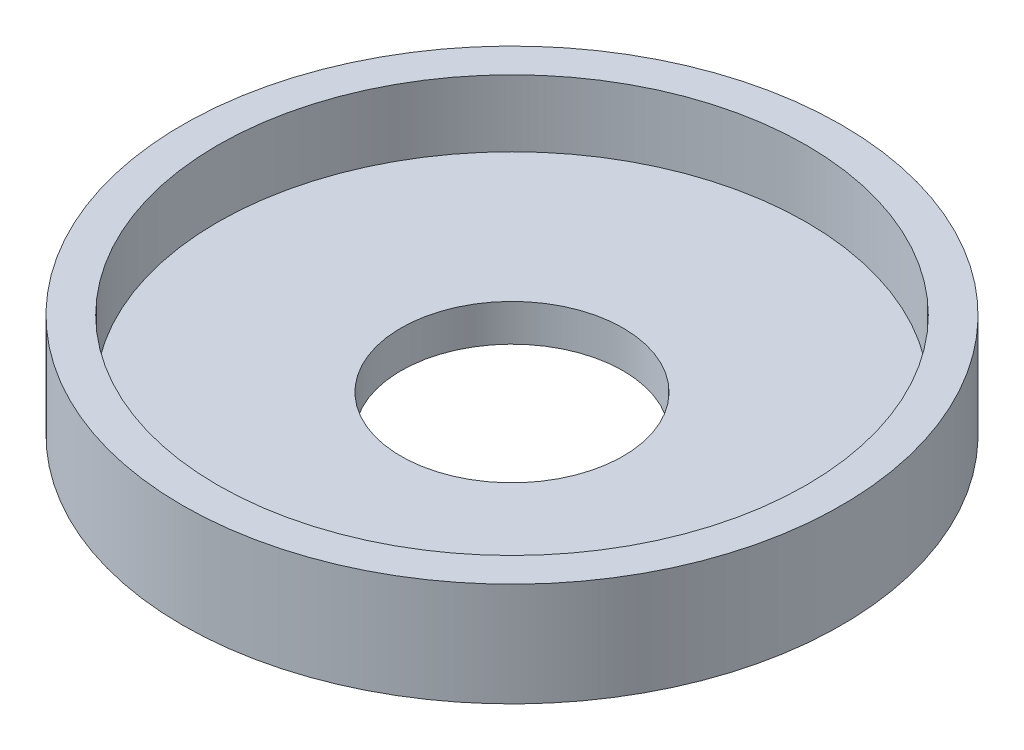
ISO-10303-21;
HEADER;
FILE_DESCRIPTION(('STEP AP214'),'2;1');
FILE_NAME('part.step','',(''),(''),'','','');
FILE_SCHEMA(('AUTOMOTIVE_DESIGN { 1 0 10303 214 1 1 1 1 }'));
ENDSEC;
DATA;
#1=APPLICATION_CONTEXT('core data for automotive mechanical design processes');
#2=APPLICATION_PROTOCOL_DEFINITION('international standard','automotive_design',2000,#1);
#3=PRODUCT_CONTEXT('',#1,'mechanical');
#4=PRODUCT('Part','Part','',(#3));
#5=PRODUCT_RELATED_PRODUCT_CATEGORY('part','',(#4));
#6=PRODUCT_DEFINITION_FORMATION('','',#4);
#7=PRODUCT_DEFINITION_CONTEXT('part definition',#1,'design');
#8=PRODUCT_DEFINITION('design','',#6,#7);
#9=PRODUCT_DEFINITION_SHAPE('','',#8);
#10=(LENGTH_UNIT() NAMED_UNIT(*) SI_UNIT(.MILLI.,.METRE.));
#11=(NAMED_UNIT(*) PLANE_ANGLE_UNIT() SI_UNIT($,.RADIAN.));
#12=(NAMED_UNIT(*) SI_UNIT($,.STERADIAN.) SOLID_ANGLE_UNIT());
#13=UNCERTAINTY_MEASURE_WITH_UNIT(LENGTH_MEASURE(1.E-05),#10,'distance_accuracy_value','');
#14=(GEOMETRIC_REPRESENTATION_CONTEXT(3) GLOBAL_UNCERTAINTY_ASSIGNED_CONTEXT((#13)) GLOBAL_UNIT_ASSIGNED_CONTEXT((#10,
#11,#12)) REPRESENTATION_CONTEXT('',''));
#15=CARTESIAN_POINT('',(0.,0.,0.));
#16=DIRECTION('',(0.,0.,1.));
#17=DIRECTION('',(1.,0.,0.));
#18=AXIS2_PLACEMENT_3D('',#15,#16,#17);
#19=CARTESIAN_POINT('',(0.,0.,0.));
#20=DIRECTION('',(0.,-1.,0.));
#21=DIRECTION('',(0.,0.,-1.));
#22=AXIS2_PLACEMENT_3D('',#19,#20,#21);
#23=CYLINDRICAL_SURFACE('',#22,6.);
#24=CARTESIAN_POINT('',(0.,2.,0.));
#25=DIRECTION('',(0.,-1.,0.));
#26=DIRECTION('',(0.,0.,-1.));
#27=AXIS2_PLACEMENT_3D('',#24,#25,#26);
#28=CIRCLE('',#27,6.);
#29=CARTESIAN_POINT('',(0.,2.,-6.));
#30=VERTEX_POINT('',#29);
#31=EDGE_CURVE('E54',#30,#30,#28,.T.);
#32=ORIENTED_EDGE('',*,*,#31,.F.);
#33=EDGE_LOOP('',(#32));
#34=FACE_BOUND('',#33,.T.);
#35=CARTESIAN_POINT('',(0.,0.,0.));
#36=DIRECTION('',(0.,-1.,0.));
#37=DIRECTION('',(0.,0.,-1.));
#38=AXIS2_PLACEMENT_3D('',#35,#36,#37);
#39=CIRCLE('',#38,6.);
#40=CARTESIAN_POINT('',(0.,0.,-6.));
#41=VERTEX_POINT('',#40);
#42=EDGE_CURVE('E10',#41,#41,#39,.T.);
#43=ORIENTED_EDGE('',*,*,#42,.T.);
#44=EDGE_LOOP('',(#43));
#45=FACE_BOUND('',#44,.T.);
#46=ADVANCED_FACE('F32',(#34,#45),#23,.F.);
#47=CARTESIAN_POINT('',(0.,0.,6.));
#48=DIRECTION('',(0.,1.,0.));
#49=DIRECTION('',(0.,0.,1.));
#50=AXIS2_PLACEMENT_3D('',#47,#48,#49);
#51=PLANE('',#50);
#52=ORIENTED_EDGE('',*,*,#42,.F.);
#53=EDGE_LOOP('',(#52));
#54=FACE_BOUND('',#53,.T.);
#55=CARTESIAN_POINT('',(0.,0.,0.));
#56=DIRECTION('',(0.,-1.,0.));
#57=DIRECTION('',(0.,0.,-1.));
#58=AXIS2_PLACEMENT_3D('',#55,#56,#57);
#59=CIRCLE('',#58,17.8);
#60=CARTESIAN_POINT('',(0.,0.,-17.8));
#61=VERTEX_POINT('',#60);
#62=EDGE_CURVE('E38',#61,#61,#59,.T.);
#63=ORIENTED_EDGE('',*,*,#62,.T.);
#64=EDGE_LOOP('',(#63));
#65=FACE_BOUND('',#64,.T.);
#66=ADVANCED_FACE('F61',(#54,#65),#51,.F.);
#67=CARTESIAN_POINT('',(0.,0.,0.));
#68=DIRECTION('',(0.,-1.,0.));
#69=DIRECTION('',(0.,0.,-1.));
#70=AXIS2_PLACEMENT_3D('',#67,#68,#69);
#71=CYLINDRICAL_SURFACE('',#70,17.8);
#72=ORIENTED_EDGE('',*,*,#62,.F.);
#73=EDGE_LOOP('',(#72));
#74=FACE_BOUND('',#73,.T.);
#75=CARTESIAN_POINT('',(0.,5.6,0.));
#76=DIRECTION('',(0.,-1.,0.));
#77=DIRECTION('',(0.,0.,-1.));
#78=AXIS2_PLACEMENT_3D('',#75,#76,#77);
#79=CIRCLE('',#78,17.8);
#80=CARTESIAN_POINT('',(0.,5.6,-17.8));
#81=VERTEX_POINT('',#80);
#82=EDGE_CURVE('E42',#81,#81,#79,.T.);
#83=ORIENTED_EDGE('',*,*,#82,.T.);
#84=EDGE_LOOP('',(#83));
#85=FACE_BOUND('',#84,.T.);
#86=ADVANCED_FACE('F65',(#74,#85),#71,.T.);
#87=CARTESIAN_POINT('',(0.,5.6,17.8));
#88=DIRECTION('',(0.,-1.,0.));
#89=DIRECTION('',(0.,0.,-1.));
#90=AXIS2_PLACEMENT_3D('',#87,#88,#89);
#91=PLANE('',#90);
#92=ORIENTED_EDGE('',*,*,#82,.F.);
#93=EDGE_LOOP('',(#92));
#94=FACE_BOUND('',#93,.T.);
#95=CARTESIAN_POINT('',(0.,5.6,0.));
#96=DIRECTION('',(0.,-1.,0.));
#97=DIRECTION('',(0.,0.,-1.));
#98=AXIS2_PLACEMENT_3D('',#95,#96,#97);
#99=CIRCLE('',#98,15.9);
#100=CARTESIAN_POINT('',(0.,5.6,-15.9));
#101=VERTEX_POINT('',#100);
#102=EDGE_CURVE('E46',#101,#101,#99,.T.);
#103=ORIENTED_EDGE('',*,*,#102,.T.);
#104=EDGE_LOOP('',(#103));
#105=FACE_BOUND('',#104,.T.);
#106=ADVANCED_FACE('F70',(#94,#105),#91,.F.);
#107=CARTESIAN_POINT('',(0.,0.,0.));
#108=DIRECTION('',(0.,-1.,0.));
#109=DIRECTION('',(0.,0.,-1.));
#110=AXIS2_PLACEMENT_3D('',#107,#108,#109);
#111=CYLINDRICAL_SURFACE('',#110,15.9);
#112=ORIENTED_EDGE('',*,*,#102,.F.);
#113=EDGE_LOOP('',(#112));
#114=FACE_BOUND('',#113,.T.);
#115=CARTESIAN_POINT('',(0.,2.,0.));
#116=DIRECTION('',(0.,-1.,0.));
#117=DIRECTION('',(0.,0.,-1.));
#118=AXIS2_PLACEMENT_3D('',#115,#116,#117);
#119=CIRCLE('',#118,15.9);
#120=CARTESIAN_POINT('',(0.,2.,-15.9));
#121=VERTEX_POINT('',#120);
#122=EDGE_CURVE('E51',#121,#121,#119,.T.);
#123=ORIENTED_EDGE('',*,*,#122,.T.);
#124=EDGE_LOOP('',(#123));
#125=FACE_BOUND('',#124,.T.);
#126=ADVANCED_FACE('F76',(#114,#125),#111,.F.);
#127=CARTESIAN_POINT('',(0.,2.,15.9));
#128=DIRECTION('',(0.,-1.,0.));
#129=DIRECTION('',(0.,0.,-1.));
#130=AXIS2_PLACEMENT_3D('',#127,#128,#129);
#131=PLANE('',#130);
#132=ORIENTED_EDGE('',*,*,#122,.F.);
#133=EDGE_LOOP('',(#132));
#134=FACE_BOUND('',#133,.T.);
#135=ORIENTED_EDGE('',*,*,#31,.T.);
#136=EDGE_LOOP('',(#135));
#137=FACE_BOUND('',#136,.T.);
#138=ADVANCED_FACE('F58',(#134,#137),#131,.F.);
#139=CLOSED_SHELL('',(#46,#66,#86,#106,#126,#138));
#140=MANIFOLD_SOLID_BREP('B2',#139);
#141=ADVANCED_BREP_SHAPE_REPRESENTATION('',(#18,#140),#14);
#142=SHAPE_DEFINITION_REPRESENTATION(#9,#141);
ENDSEC;
END-ISO-10303-21;
